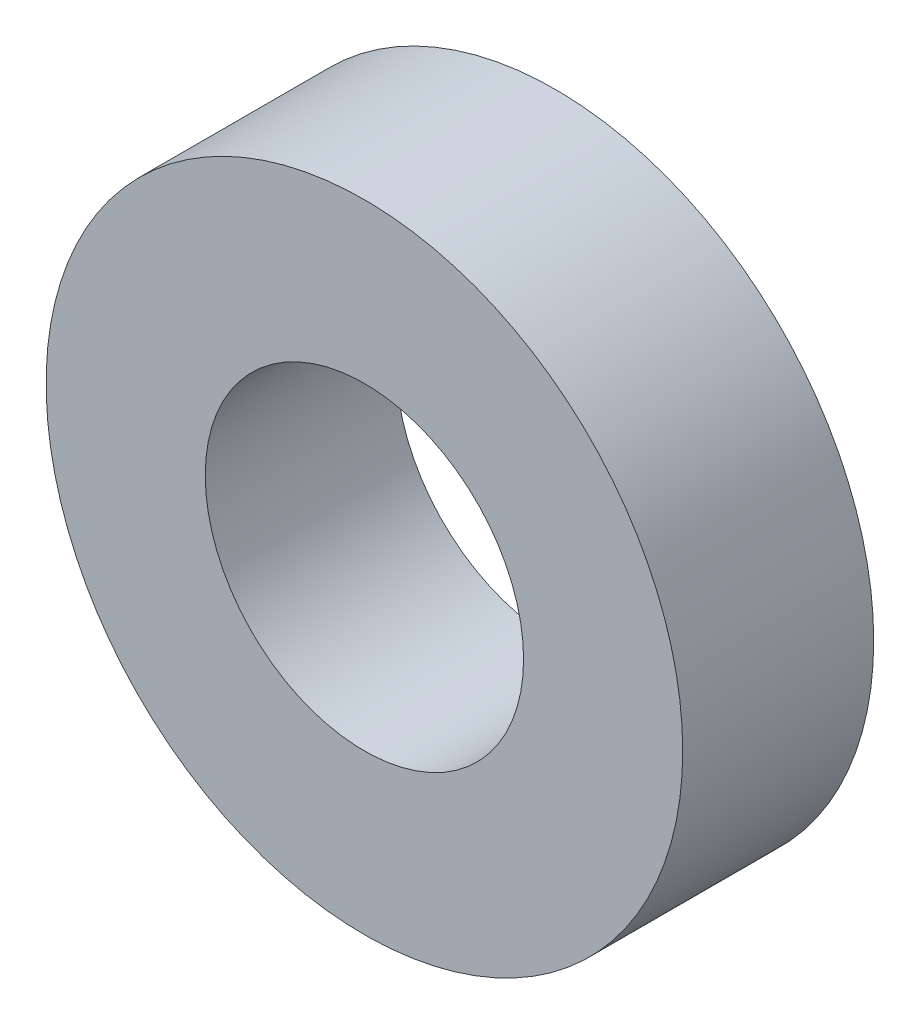
ISO-10303-21;
HEADER;
FILE_DESCRIPTION(('STEP AP214'),'2;1');
FILE_NAME('part.step','',(''),(''),'','','');
FILE_SCHEMA(('AUTOMOTIVE_DESIGN { 1 0 10303 214 1 1 1 1 }'));
ENDSEC;
DATA;
#1=APPLICATION_CONTEXT('core data for automotive mechanical design processes');
#2=APPLICATION_PROTOCOL_DEFINITION('international standard','automotive_design',2000,#1);
#3=PRODUCT_CONTEXT('',#1,'mechanical');
#4=PRODUCT('Part','Part','',(#3));
#5=PRODUCT_RELATED_PRODUCT_CATEGORY('part','',(#4));
#6=PRODUCT_DEFINITION_FORMATION('','',#4);
#7=PRODUCT_DEFINITION_CONTEXT('part definition',#1,'design');
#8=PRODUCT_DEFINITION('design','',#6,#7);
#9=PRODUCT_DEFINITION_SHAPE('','',#8);
#10=(LENGTH_UNIT() NAMED_UNIT(*) SI_UNIT(.MILLI.,.METRE.));
#11=(NAMED_UNIT(*) PLANE_ANGLE_UNIT() SI_UNIT($,.RADIAN.));
#12=(NAMED_UNIT(*) SI_UNIT($,.STERADIAN.) SOLID_ANGLE_UNIT());
#13=UNCERTAINTY_MEASURE_WITH_UNIT(LENGTH_MEASURE(1.E-05),#10,'distance_accuracy_value','');
#14=(GEOMETRIC_REPRESENTATION_CONTEXT(3) GLOBAL_UNCERTAINTY_ASSIGNED_CONTEXT((#13)) GLOBAL_UNIT_ASSIGNED_CONTEXT((#10,
#11,#12)) REPRESENTATION_CONTEXT('',''));
#15=CARTESIAN_POINT('',(0.,0.,0.));
#16=DIRECTION('',(0.,0.,1.));
#17=DIRECTION('',(1.,0.,0.));
#18=AXIS2_PLACEMENT_3D('',#15,#16,#17);
#19=CARTESIAN_POINT('',(0.,0.,3.));
#20=DIRECTION('',(0.,0.,-1.));
#21=DIRECTION('',(-1.,0.,0.));
#22=AXIS2_PLACEMENT_3D('',#19,#20,#21);
#23=CYLINDRICAL_SURFACE('',#22,5.);
#24=CARTESIAN_POINT('',(0.,0.,3.));
#25=DIRECTION('',(0.,0.,1.));
#26=DIRECTION('',(1.,0.,0.));
#27=AXIS2_PLACEMENT_3D('',#24,#25,#26);
#28=CIRCLE('',#27,5.);
#29=CARTESIAN_POINT('',(5.,0.,3.));
#30=VERTEX_POINT('',#29);
#31=EDGE_CURVE('E10',#30,#30,#28,.T.);
#32=ORIENTED_EDGE('',*,*,#31,.F.);
#33=EDGE_LOOP('',(#32));
#34=FACE_BOUND('',#33,.T.);
#35=CARTESIAN_POINT('',(0.,0.,0.));
#36=DIRECTION('',(0.,0.,1.));
#37=DIRECTION('',(1.,0.,0.));
#38=AXIS2_PLACEMENT_3D('',#35,#36,#37);
#39=CIRCLE('',#38,5.);
#40=CARTESIAN_POINT('',(5.,0.,0.));
#41=VERTEX_POINT('',#40);
#42=EDGE_CURVE('E38',#41,#41,#39,.T.);
#43=ORIENTED_EDGE('',*,*,#42,.T.);
#44=EDGE_LOOP('',(#43));
#45=FACE_BOUND('',#44,.T.);
#46=ADVANCED_FACE('F35',(#34,#45),#23,.T.);
#47=CARTESIAN_POINT('',(0.,0.,3.));
#48=DIRECTION('',(0.,0.,1.));
#49=DIRECTION('',(1.,0.,0.));
#50=AXIS2_PLACEMENT_3D('',#47,#48,#49);
#51=PLANE('',#50);
#52=CARTESIAN_POINT('',(0.,0.,3.));
#53=DIRECTION('',(0.,0.,1.));
#54=DIRECTION('',(1.,0.,0.));
#55=AXIS2_PLACEMENT_3D('',#52,#53,#54);
#56=CIRCLE('',#55,2.5);
#57=CARTESIAN_POINT('',(2.5,0.,3.));
#58=VERTEX_POINT('',#57);
#59=EDGE_CURVE('E49',#58,#58,#56,.T.);
#60=ORIENTED_EDGE('',*,*,#59,.F.);
#61=EDGE_LOOP('',(#60));
#62=FACE_BOUND('',#61,.T.);
#63=ORIENTED_EDGE('',*,*,#31,.T.);
#64=EDGE_LOOP('',(#63));
#65=FACE_BOUND('',#64,.T.);
#66=ADVANCED_FACE('F55',(#62,#65),#51,.T.);
#67=CARTESIAN_POINT('',(0.,0.,0.));
#68=DIRECTION('',(0.,0.,1.));
#69=DIRECTION('',(1.,0.,0.));
#70=AXIS2_PLACEMENT_3D('',#67,#68,#69);
#71=PLANE('',#70);
#72=CARTESIAN_POINT('',(0.,0.,0.));
#73=DIRECTION('',(0.,0.,1.));
#74=DIRECTION('',(1.,0.,0.));
#75=AXIS2_PLACEMENT_3D('',#72,#73,#74);
#76=CIRCLE('',#75,2.5);
#77=CARTESIAN_POINT('',(2.5,0.,0.));
#78=VERTEX_POINT('',#77);
#79=EDGE_CURVE('E45',#78,#78,#76,.T.);
#80=ORIENTED_EDGE('',*,*,#79,.T.);
#81=EDGE_LOOP('',(#80));
#82=FACE_BOUND('',#81,.T.);
#83=ORIENTED_EDGE('',*,*,#42,.F.);
#84=EDGE_LOOP('',(#83));
#85=FACE_BOUND('',#84,.T.);
#86=ADVANCED_FACE('F57',(#82,#85),#71,.F.);
#87=CARTESIAN_POINT('',(0.,0.,3.));
#88=DIRECTION('',(0.,0.,1.));
#89=DIRECTION('',(1.,0.,0.));
#90=AXIS2_PLACEMENT_3D('',#87,#88,#89);
#91=CYLINDRICAL_SURFACE('',#90,2.5);
#92=ORIENTED_EDGE('',*,*,#79,.F.);
#93=EDGE_LOOP('',(#92));
#94=FACE_BOUND('',#93,.T.);
#95=ORIENTED_EDGE('',*,*,#59,.T.);
#96=EDGE_LOOP('',(#95));
#97=FACE_BOUND('',#96,.T.);
#98=ADVANCED_FACE('F53',(#94,#97),#91,.F.);
#99=CLOSED_SHELL('',(#46,#66,#86,#98));
#100=MANIFOLD_SOLID_BREP('B2',#99);
#101=ADVANCED_BREP_SHAPE_REPRESENTATION('',(#18,#100),#14);
#102=SHAPE_DEFINITION_REPRESENTATION(#9,#101);
ENDSEC;
END-ISO-10303-21;
